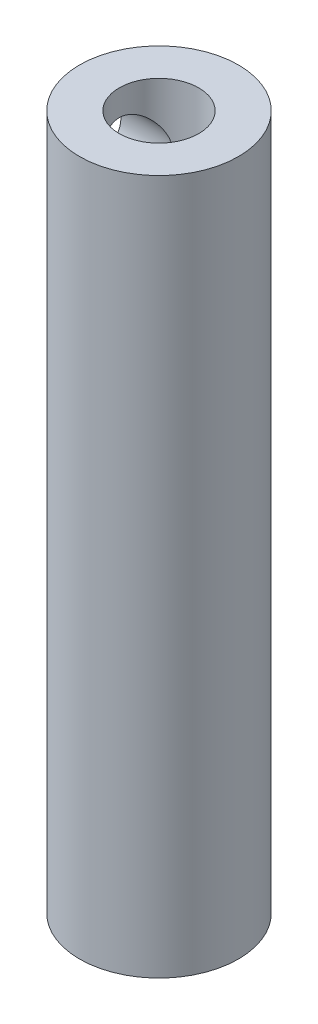
ISO-10303-21;
HEADER;
FILE_DESCRIPTION(('STEP AP214'),'2;1');
FILE_NAME('part.step','',(''),(''),'','','');
FILE_SCHEMA(('AUTOMOTIVE_DESIGN { 1 0 10303 214 1 1 1 1 }'));
ENDSEC;
DATA;
#1=APPLICATION_CONTEXT('core data for automotive mechanical design processes');
#2=APPLICATION_PROTOCOL_DEFINITION('international standard','automotive_design',2000,#1);
#3=PRODUCT_CONTEXT('',#1,'mechanical');
#4=PRODUCT('Part','Part','',(#3));
#5=PRODUCT_RELATED_PRODUCT_CATEGORY('part','',(#4));
#6=PRODUCT_DEFINITION_FORMATION('','',#4);
#7=PRODUCT_DEFINITION_CONTEXT('part definition',#1,'design');
#8=PRODUCT_DEFINITION('design','',#6,#7);
#9=PRODUCT_DEFINITION_SHAPE('','',#8);
#10=(LENGTH_UNIT() NAMED_UNIT(*) SI_UNIT(.MILLI.,.METRE.));
#11=(NAMED_UNIT(*) PLANE_ANGLE_UNIT() SI_UNIT($,.RADIAN.));
#12=(NAMED_UNIT(*) SI_UNIT($,.STERADIAN.) SOLID_ANGLE_UNIT());
#13=UNCERTAINTY_MEASURE_WITH_UNIT(LENGTH_MEASURE(1.E-05),#10,'distance_accuracy_value','');
#14=(GEOMETRIC_REPRESENTATION_CONTEXT(3) GLOBAL_UNCERTAINTY_ASSIGNED_CONTEXT((#13)) GLOBAL_UNIT_ASSIGNED_CONTEXT((#10,
#11,#12)) REPRESENTATION_CONTEXT('',''));
#15=CARTESIAN_POINT('',(0.,0.,0.));
#16=DIRECTION('',(0.,0.,1.));
#17=DIRECTION('',(1.,0.,0.));
#18=AXIS2_PLACEMENT_3D('',#15,#16,#17);
#19=CARTESIAN_POINT('',(0.,35.,0.));
#20=DIRECTION('',(0.,-1.,0.));
#21=DIRECTION('',(0.,0.,-1.));
#22=AXIS2_PLACEMENT_3D('',#19,#20,#21);
#23=CYLINDRICAL_SURFACE('',#22,4.);
#24=CARTESIAN_POINT('',(-3.62077339804634,32.,1.7));
#25=CARTESIAN_POINT('',(-3.62078389776822,31.9095136925962,1.69998931587784));
#26=CARTESIAN_POINT('',(-3.62421505367056,31.818887436566,1.69272971233163));
#27=CARTESIAN_POINT('',(-3.63750095648767,31.6402616540762,1.66397708018132));
#28=CARTESIAN_POINT('',(-3.64737281734679,31.5522697809394,1.64244612797097));
#29=CARTESIAN_POINT('',(-3.67220059629412,31.3818244806839,1.58615188365144));
#30=CARTESIAN_POINT('',(-3.68713519255218,31.2993495351598,1.55144401409242));
#31=CARTESIAN_POINT('',(-3.72037538198184,31.1414157505776,1.46994425999662));
#32=CARTESIAN_POINT('',(-3.73868027222187,31.0659554534262,1.42315489444196));
#33=CARTESIAN_POINT('',(-3.77792419156349,30.919259320318,1.31557971646441));
#34=CARTESIAN_POINT('',(-3.79895480957319,30.8485324995426,1.25413286768261));
#35=CARTESIAN_POINT('',(-3.84052932399883,30.7180095016102,1.12037385385952));
#36=CARTESIAN_POINT('',(-3.86107302551083,30.6582176392885,1.0480574201965));
#37=CARTESIAN_POINT('',(-3.90047994287595,30.5486282225362,0.890578070051302));
#38=CARTESIAN_POINT('',(-3.91922435158922,30.499408386334,0.804980679500432));
#39=CARTESIAN_POINT('',(-3.9517936883622,30.4162886166107,0.625779619556143));
#40=CARTESIAN_POINT('',(-3.96562088331569,30.3823816217372,0.532179664191152));
#41=CARTESIAN_POINT('',(-3.98614740911361,30.332710381214,0.344979513320471));
#42=CARTESIAN_POINT('',(-3.99319065604463,30.3160670178677,0.251651070591721));
#43=CARTESIAN_POINT('',(-4.00060815688424,30.2985497752618,0.0632783663420337));
#44=CARTESIAN_POINT('',(-4.00098523182037,30.2976692254058,-0.0317651523372097));
#45=CARTESIAN_POINT('',(-3.99522684956492,30.3112529689857,-0.214458466615303));
#46=CARTESIAN_POINT('',(-3.98950193441317,30.324749910631,-0.302195592459981));
#47=CARTESIAN_POINT('',(-3.97275194397345,30.3650406061082,-0.474021630551051));
#48=CARTESIAN_POINT('',(-3.96172647725524,30.3918353419478,-0.558110272867535));
#49=CARTESIAN_POINT('',(-3.93522368744884,30.4582722750843,-0.721803742779873));
#50=CARTESIAN_POINT('',(-3.91968084499471,30.4981047279113,-0.801320306141919));
#51=CARTESIAN_POINT('',(-3.88565313854627,30.5892953008207,-0.952749650325255));
#52=CARTESIAN_POINT('',(-3.86716722297728,30.640657543254,-1.02465969795704));
#53=CARTESIAN_POINT('',(-3.82750663559037,30.757800507865,-1.16440871156805));
#54=CARTESIAN_POINT('',(-3.80623419529478,30.8243594975726,-1.23156848333512));
#55=CARTESIAN_POINT('',(-3.76439681745492,30.9678239513226,-1.35407381215316));
#56=CARTESIAN_POINT('',(-3.74383217834637,31.0447337141281,-1.40941443577706));
#57=CARTESIAN_POINT('',(-3.70502399721272,31.2101401688352,-1.50855500222399));
#58=CARTESIAN_POINT('',(-3.68688823684044,31.2989504039897,-1.55187769268165));
#59=CARTESIAN_POINT('',(-3.65628757041348,31.4835805163489,-1.62267252189394));
#60=CARTESIAN_POINT('',(-3.64381842070352,31.5793950854602,-1.6501565261958));
#61=CARTESIAN_POINT('',(-3.62702749350719,31.7684983019597,-1.68672841059021));
#62=CARTESIAN_POINT('',(-3.62221773340993,31.8615291175216,-1.69692109964447));
#63=CARTESIAN_POINT('',(-3.61989322841417,32.0480762325109,-1.70187704278063));
#64=CARTESIAN_POINT('',(-3.62237578496444,32.1415923395692,-1.69664600447243));
#65=CARTESIAN_POINT('',(-3.63385039181918,32.3197683825884,-1.67191223339995));
#66=CARTESIAN_POINT('',(-3.64238974686291,32.4045989220652,-1.65340103574668));
#67=CARTESIAN_POINT('',(-3.66442865789702,32.5698728304785,-1.60396059683754));
#68=CARTESIAN_POINT('',(-3.67792940476492,32.650315140785,-1.57302837401107));
#69=CARTESIAN_POINT('',(-3.7090779402313,32.8084134508917,-1.49814807525468));
#70=CARTESIAN_POINT('',(-3.72687955099295,32.8857993962254,-1.45369590780971));
#71=CARTESIAN_POINT('',(-3.76441339227635,33.0323950596591,-1.35353226876144));
#72=CARTESIAN_POINT('',(-3.78414647967388,33.1016011185229,-1.29781578809865));
#73=CARTESIAN_POINT('',(-3.82535166604392,33.2360237838682,-1.17110429325259));
#74=CARTESIAN_POINT('',(-3.84682843975983,33.3003957330982,-1.09921112338328));
#75=CARTESIAN_POINT('',(-3.88754721100944,33.416324110372,-0.945155108949408));
#76=CARTESIAN_POINT('',(-3.90678900343043,33.4678793626733,-0.862991323245852));
#77=CARTESIAN_POINT('',(-3.94103107719546,33.556733022639,-0.689980032155145));
#78=CARTESIAN_POINT('',(-3.95601331647128,33.5939710147984,-0.599097707378483));
#79=CARTESIAN_POINT('',(-3.97989121280153,33.6523470048471,-0.411555216738269));
#80=CARTESIAN_POINT('',(-3.98879065469919,33.6734950151868,-0.314898684498714));
#81=CARTESIAN_POINT('',(-3.9990489958153,33.6977931006144,-0.126084955840315));
#82=CARTESIAN_POINT('',(-4.00090603247313,33.7021326282122,-0.0341069160918674));
#83=CARTESIAN_POINT('',(-3.99826543244609,33.6959174191764,0.149241085779918));
#84=CARTESIAN_POINT('',(-3.99376899105789,33.6853654841136,0.240611159032687));
#85=CARTESIAN_POINT('',(-3.97919382980664,33.6505207493148,0.416560481880022));
#86=CARTESIAN_POINT('',(-3.96933380737085,33.6267655308726,0.501265842353938));
#87=CARTESIAN_POINT('',(-3.94513266199835,33.5667872702492,0.665447707792311));
#88=CARTESIAN_POINT('',(-3.93079070613533,33.5305619104791,0.744923237514438));
#89=CARTESIAN_POINT('',(-3.8981931765112,33.4448358087029,0.900380438212713));
#90=CARTESIAN_POINT('',(-3.87978917350281,33.3948058369909,0.976038394360143));
#91=CARTESIAN_POINT('',(-3.84122862577445,33.2836481674676,1.118211865535));
#92=CARTESIAN_POINT('',(-3.8210714015288,33.2225161565732,1.18472380967696));
#93=CARTESIAN_POINT('',(-3.77946315895161,33.0857613862788,1.31165271688526));
#94=CARTESIAN_POINT('',(-3.75802228942074,33.0094164933923,1.37129773860273));
#95=CARTESIAN_POINT('',(-3.71772952713886,32.8471570184193,1.47705876845357));
#96=CARTESIAN_POINT('',(-3.69887912452728,32.7612369793602,1.52316700687638));
#97=CARTESIAN_POINT('',(-3.66623132404758,32.582210832153,1.60015623012625));
#98=CARTESIAN_POINT('',(-3.65241922289075,32.4891266098767,1.63108161598059));
#99=CARTESIAN_POINT('',(-3.63183106374555,32.2984664254959,1.67643974797453));
#100=CARTESIAN_POINT('',(-3.62503141264755,32.2009066860975,1.69092781340853));
#101=CARTESIAN_POINT('',(-3.62125776494451,32.0686373471819,1.69896477261701));
#102=CARTESIAN_POINT('',(-3.62076941465609,32.0343287449659,1.70000405334813));
#103=CARTESIAN_POINT('',(-3.62077339804634,32.,1.7));
#104=B_SPLINE_CURVE_WITH_KNOTS('',3,(#24,#25,#26,#27,#28,#29,#30,#31,#32,#33,#34,#35,#36,#37,
#38,#39,#40,#41,#42,#43,#44,#45,#46,#47,#48,#49,#50,#51,#52,#53,#54,#55,#56,#57,#58,#59,#60,#61,
#62,#63,#64,#65,#66,#67,#68,#69,#70,#71,#72,#73,#74,#75,#76,#77,#78,#79,#80,#81,#82,#83,#84,#85,
#86,#87,#88,#89,#90,#91,#92,#93,#94,#95,#96,#97,#98,#99,#100,#101,#102,#103),.UNSPECIFIED.,.T.,
.F.,(4,2,2,2,2,2,2,2,2,2,2,2,2,2,2,2,2,2,2,2,2,2,2,2,2,2,2,2,2,2,2,2,2,2,2,2,2,2,2,4),(0.,
0.271357429217211,0.543438849684194,0.81438834225994,1.08528138763888,1.3720970991645,
1.65902574252361,1.95899463692504,2.25882506229057,2.54250020592688,2.82605529947181,
3.09166970443069,3.35730372725016,3.62700110584538,3.89679506582232,4.18626169238784,
4.47584891000081,4.77567555447247,5.07527729092642,5.35489435511071,5.63440795890816,
5.89497300357031,6.15560063227203,6.42747562422463,6.69947178160411,6.99468311182854,
7.28992151334518,7.58639242540035,7.88267869873597,8.15756828963533,8.4324061717119,
8.69679659632972,8.96123618473687,9.23771295195231,9.51429735959075,9.81058879533077,
10.1070499625391,10.4026389106496,10.6972300845991,10.800177815029),.UNSPECIFIED.);
#105=CARTESIAN_POINT('',(-3.62077339804634,32.,1.7));
#106=VERTEX_POINT('',#105);
#107=EDGE_CURVE('E10',#106,#106,#104,.T.);
#108=ORIENTED_EDGE('',*,*,#107,.T.);
#109=EDGE_LOOP('',(#108));
#110=FACE_BOUND('',#109,.T.);
#111=CARTESIAN_POINT('',(0.,35.,0.));
#112=DIRECTION('',(0.,1.,0.));
#113=DIRECTION('',(0.,0.,1.));
#114=AXIS2_PLACEMENT_3D('',#111,#112,#113);
#115=CIRCLE('',#114,4.);
#116=CARTESIAN_POINT('',(0.,35.,4.));
#117=VERTEX_POINT('',#116);
#118=EDGE_CURVE('E41',#117,#117,#115,.T.);
#119=ORIENTED_EDGE('',*,*,#118,.F.);
#120=EDGE_LOOP('',(#119));
#121=FACE_BOUND('',#120,.T.);
#122=CARTESIAN_POINT('',(0.,0.,0.));
#123=DIRECTION('',(0.,1.,0.));
#124=DIRECTION('',(0.,0.,1.));
#125=AXIS2_PLACEMENT_3D('',#122,#123,#124);
#126=CIRCLE('',#125,4.);
#127=CARTESIAN_POINT('',(0.,0.,4.));
#128=VERTEX_POINT('',#127);
#129=EDGE_CURVE('E45',#128,#128,#126,.T.);
#130=ORIENTED_EDGE('',*,*,#129,.T.);
#131=EDGE_LOOP('',(#130));
#132=FACE_BOUND('',#131,.T.);
#133=ADVANCED_FACE('F31',(#110,#121,#132),#23,.T.);
#134=CARTESIAN_POINT('',(0.,35.,0.));
#135=DIRECTION('',(0.,1.,0.));
#136=DIRECTION('',(0.,0.,1.));
#137=AXIS2_PLACEMENT_3D('',#134,#135,#136);
#138=PLANE('',#137);
#139=CARTESIAN_POINT('',(0.,35.,0.));
#140=DIRECTION('',(0.,1.,0.));
#141=DIRECTION('',(0.,0.,1.));
#142=AXIS2_PLACEMENT_3D('',#139,#140,#141);
#143=CIRCLE('',#142,2.);
#144=CARTESIAN_POINT('',(0.,35.,2.));
#145=VERTEX_POINT('',#144);
#146=EDGE_CURVE('E52',#145,#145,#143,.T.);
#147=ORIENTED_EDGE('',*,*,#146,.F.);
#148=EDGE_LOOP('',(#147));
#149=FACE_BOUND('',#148,.T.);
#150=ORIENTED_EDGE('',*,*,#118,.T.);
#151=EDGE_LOOP('',(#150));
#152=FACE_BOUND('',#151,.T.);
#153=ADVANCED_FACE('F80',(#149,#152),#138,.T.);
#154=CARTESIAN_POINT('',(0.,0.,0.));
#155=DIRECTION('',(0.,1.,0.));
#156=DIRECTION('',(0.,0.,1.));
#157=AXIS2_PLACEMENT_3D('',#154,#155,#156);
#158=PLANE('',#157);
#159=ORIENTED_EDGE('',*,*,#129,.F.);
#160=EDGE_LOOP('',(#159));
#161=FACE_BOUND('',#160,.T.);
#162=ADVANCED_FACE('F77',(#161),#158,.F.);
#163=CARTESIAN_POINT('',(0.,25.,0.));
#164=DIRECTION('',(0.,1.,0.));
#165=DIRECTION('',(0.,0.,1.));
#166=AXIS2_PLACEMENT_3D('',#163,#164,#165);
#167=CYLINDRICAL_SURFACE('',#166,2.);
#168=CARTESIAN_POINT('',(-1.05356537528528,32.,1.7));
#169=CARTESIAN_POINT('',(-1.0535865391497,32.0579969876084,1.69999209353776));
#170=CARTESIAN_POINT('',(-1.05846416247034,32.1160712056181,1.69699341427168));
#171=CARTESIAN_POINT('',(-1.07694415181595,32.2302941941207,1.68531810769261));
#172=CARTESIAN_POINT('',(-1.09057797998307,32.2864352489887,1.67662100293753));
#173=CARTESIAN_POINT('',(-1.13108259855175,32.4180078786746,1.64968082581871));
#174=CARTESIAN_POINT('',(-1.16108669082666,32.4919371171079,1.62898823756465));
#175=CARTESIAN_POINT('',(-1.22787010969714,32.6337248046924,1.57926447079485));
#176=CARTESIAN_POINT('',(-1.26467231483019,32.701561568797,1.55020494374478));
#177=CARTESIAN_POINT('',(-1.33159048933568,32.8152672380987,1.49274984380142));
#178=CARTESIAN_POINT('',(-1.36106425910824,32.8623743748959,1.46602060494138));
#179=CARTESIAN_POINT('',(-1.4206068170519,32.9535810134619,1.40840212528898));
#180=CARTESIAN_POINT('',(-1.4506758793521,32.9976790859571,1.37751092804804));
#181=CARTESIAN_POINT('',(-1.540391428907,33.1253921130372,1.27870069797039));
#182=CARTESIAN_POINT('',(-1.59967379601292,33.204629062381,1.20454185093214));
#183=CARTESIAN_POINT('',(-1.6991559367518,33.3335598904778,1.05779848838552));
#184=CARTESIAN_POINT('',(-1.74068803635965,33.385920768851,0.988441684600398));
#185=CARTESIAN_POINT('',(-1.81701226861221,33.480650604137,0.839882315936324));
#186=CARTESIAN_POINT('',(-1.85181552120821,33.523036071839,0.760696356430929));
#187=CARTESIAN_POINT('',(-1.90658117573437,33.5891273039267,0.608501762552866));
#188=CARTESIAN_POINT('',(-1.92808383853929,33.6148170149589,0.536914240950147));
#189=CARTESIAN_POINT('',(-1.96324342803797,33.6566395251948,0.389137658874133));
#190=CARTESIAN_POINT('',(-1.97690494882648,33.6727779206503,0.312951321808487));
#191=CARTESIAN_POINT('',(-1.99531639754419,33.6944973023532,0.157641560880517));
#192=CARTESIAN_POINT('',(-2.00002539694724,33.7000298022473,0.0785063262071438));
#193=CARTESIAN_POINT('',(-1.99997440786115,33.6999699681093,-0.0797561244111584));
#194=CARTESIAN_POINT('',(-1.99521519509274,33.6943785454486,-0.158883340481886));
#195=CARTESIAN_POINT('',(-1.97736113063873,33.6733154790453,-0.308737410975696));
#196=CARTESIAN_POINT('',(-1.96490923253137,33.6586056552615,-0.379652571436747));
#197=CARTESIAN_POINT('',(-1.93315996846712,33.6208673962779,-0.517596839641206));
#198=CARTESIAN_POINT('',(-1.91386152687525,33.5978376539564,-0.584625334838861));
#199=CARTESIAN_POINT('',(-1.86781902754465,33.5424026866156,-0.718801577563779));
#200=CARTESIAN_POINT('',(-1.84060628121434,33.5093993180463,-0.785538209496984));
#201=CARTESIAN_POINT('',(-1.78109652308424,33.436229850535,-0.912480875898615));
#202=CARTESIAN_POINT('',(-1.74879554087872,33.3960581547916,-0.972681747952854));
#203=CARTESIAN_POINT('',(-1.66367783669771,33.2881848025844,-1.11444505894733));
#204=CARTESIAN_POINT('',(-1.60862821526641,33.2167072637636,-1.19180461135557));
#205=CARTESIAN_POINT('',(-1.49519576454598,33.0622669623057,-1.33134355517151));
#206=CARTESIAN_POINT('',(-1.43680588820473,32.9792793488295,-1.39348927403084));
#207=CARTESIAN_POINT('',(-1.33560565081163,32.8225278157227,-1.48992153907624));
#208=CARTESIAN_POINT('',(-1.29228603965747,32.7509944251612,-1.52732903885879));
#209=CARTESIAN_POINT('',(-1.21115764881017,32.6007563716037,-1.59240971181971));
#210=CARTESIAN_POINT('',(-1.17333262599745,32.5220740117466,-1.62011193334315));
#211=CARTESIAN_POINT('',(-1.12174912939406,32.3880115626178,-1.65598220392296));
#212=CARTESIAN_POINT('',(-1.10429085307099,32.335007261131,-1.66757817522879));
#213=CARTESIAN_POINT('',(-1.07634688979503,32.2264025966488,-1.68575136889507));
#214=CARTESIAN_POINT('',(-1.06584358593808,32.170809177588,-1.69234127787066));
#215=CARTESIAN_POINT('',(-1.05364022423823,32.0576891921143,-1.69997188075843));
#216=CARTESIAN_POINT('',(-1.05202380560274,32.0001493702366,-1.70095985458385));
#217=CARTESIAN_POINT('',(-1.05819368520095,31.8857546666464,-1.69712521354873));
#218=CARTESIAN_POINT('',(-1.06598990302157,31.8289005714107,-1.69229646870194));
#219=CARTESIAN_POINT('',(-1.09174803921428,31.7063831938381,-1.67581445898948));
#220=CARTESIAN_POINT('',(-1.11144700712543,31.6412637551221,-1.66297849578291));
#221=CARTESIAN_POINT('',(-1.15819537133674,31.5153639909899,-1.63076153967505));
#222=CARTESIAN_POINT('',(-1.18527033957442,31.4545997078671,-1.61135771876846));
#223=CARTESIAN_POINT('',(-1.23839222376261,31.3478086163342,-1.57076420948407));
#224=CARTESIAN_POINT('',(-1.26376891139426,31.3010801036612,-1.55050252767248));
#225=CARTESIAN_POINT('',(-1.31613618649843,31.2103264983711,-1.50630785201208));
#226=CARTESIAN_POINT('',(-1.34312773977883,31.166303056138,-1.48237264746023));
#227=CARTESIAN_POINT('',(-1.42515792176047,31.0379984781566,-1.40518374468282));
#228=CARTESIAN_POINT('',(-1.48122788454067,30.9575276545874,-1.34656406295446));
#229=CARTESIAN_POINT('',(-1.59308814278739,30.8038523323277,-1.21245869465718));
#230=CARTESIAN_POINT('',(-1.64876806742133,30.7310941751382,-1.13636871801782));
#231=CARTESIAN_POINT('',(-1.75240887594904,30.5990734955405,-0.968861849498815));
#232=CARTESIAN_POINT('',(-1.80039286591852,30.5397703450762,-0.877492585814875));
#233=CARTESIAN_POINT('',(-1.8705603997189,30.4542373032738,-0.711602749491723));
#234=CARTESIAN_POINT('',(-1.89611023700009,30.4234733378396,-0.64083760329226));
#235=CARTESIAN_POINT('',(-1.93962462353878,30.3713961005599,-0.493683487802223));
#236=CARTESIAN_POINT('',(-1.9575948217246,30.350075789982,-0.417298756698768));
#237=CARTESIAN_POINT('',(-1.98460480421611,30.3181172086044,-0.260242591839756));
#238=CARTESIAN_POINT('',(-1.99358857090647,30.3075459361047,-0.179547531981826));
#239=CARTESIAN_POINT('',(-2.00158035195772,30.2981390046393,-0.0169856320256852));
#240=CARTESIAN_POINT('',(-2.00059177312242,30.2992993378625,0.0648807983594134));
#241=CARTESIAN_POINT('',(-1.98932419140323,30.3125699293231,0.21907037132619));
#242=CARTESIAN_POINT('',(-1.97994433068417,30.3236204805623,0.29155638997955));
#243=CARTESIAN_POINT('',(-1.95384288748472,30.3545303540401,0.433231940291043));
#244=CARTESIAN_POINT('',(-1.93711972391115,30.3743915733211,0.50242075846762));
#245=CARTESIAN_POINT('',(-1.89653927098457,30.422962384739,0.639099574523981));
#246=CARTESIAN_POINT('',(-1.87239791787222,30.4520260370968,0.706377365385048));
#247=CARTESIAN_POINT('',(-1.81872179526714,30.5174022780211,0.834932229603046));
#248=CARTESIAN_POINT('',(-1.78918566938265,30.5537166898389,0.896207787870503));
#249=CARTESIAN_POINT('',(-1.71091060380423,30.6515005503062,1.0403705430262));
#250=CARTESIAN_POINT('',(-1.65977349850707,30.7166626502332,1.11945639862046));
#251=CARTESIAN_POINT('',(-1.55283945613768,30.8582842851909,1.26363362707695));
#252=CARTESIAN_POINT('',(-1.49702395653074,30.934789848882,1.32866519761275));
#253=CARTESIAN_POINT('',(-1.41297411987472,31.057979028225,1.41604686738013));
#254=CARTESIAN_POINT('',(-1.38462093167345,31.1009153762359,1.44370098494875));
#255=CARTESIAN_POINT('',(-1.32876164714129,31.1895686034912,1.49527077077826));
#256=CARTESIAN_POINT('',(-1.30125604387866,31.2352870568377,1.51918429479166));
#257=CARTESIAN_POINT('',(-1.24826463387982,31.3294235289084,1.56301367792193));
#258=CARTESIAN_POINT('',(-1.22277046023881,31.3778287629546,1.58294669002176));
#259=CARTESIAN_POINT('',(-1.17511740131887,31.4776773758036,1.61863632739282));
#260=CARTESIAN_POINT('',(-1.15295358494648,31.529116102618,1.63439915410738));
#261=CARTESIAN_POINT('',(-1.1139561494244,31.6348935805192,1.66122222386113));
#262=CARTESIAN_POINT('',(-1.09709510990122,31.6892156564824,1.67230676348317));
#263=CARTESIAN_POINT('',(-1.07097877600694,31.8003484786753,1.689159508811));
#264=CARTESIAN_POINT('',(-1.06169078613592,31.8571473992388,1.69495058152883));
#265=CARTESIAN_POINT('',(-1.05472385187238,31.9428584986647,1.69928151774383));
#266=CARTESIAN_POINT('',(-1.05355494602029,31.9714198720766,1.70000389619722));
#267=CARTESIAN_POINT('',(-1.05356537528528,32.,1.7));
#268=B_SPLINE_CURVE_WITH_KNOTS('',3,(#168,#169,#170,#171,#172,#173,#174,#175,#176,#177,#178,
#179,#180,#181,#182,#183,#184,#185,#186,#187,#188,#189,#190,#191,#192,#193,#194,#195,#196,#197,
#198,#199,#200,#201,#202,#203,#204,#205,#206,#207,#208,#209,#210,#211,#212,#213,#214,#215,#216,
#217,#218,#219,#220,#221,#222,#223,#224,#225,#226,#227,#228,#229,#230,#231,#232,#233,#234,#235,
#236,#237,#238,#239,#240,#241,#242,#243,#244,#245,#246,#247,#248,#249,#250,#251,#252,#253,#254,
#255,#256,#257,#258,#259,#260,#261,#262,#263,#264,#265,#266,#267),.UNSPECIFIED.,.T.,.F.,(4,2,2,
2,2,2,2,2,2,2,2,2,2,2,2,2,2,2,2,2,2,2,2,2,2,2,2,2,2,2,2,2,2,2,2,2,2,2,2,2,2,2,2,2,2,2,2,2,2,4),
(0.,0.173879418884634,0.34838713050625,0.594273916217876,0.841003812098058,1.02576540468018,
1.2106141547992,1.57953716462817,1.86747817174354,2.15493918820206,2.39107901360164,
2.6270803439883,2.86415803868535,3.1012163106546,3.32073083217672,3.54027985609209,
3.77721956251101,4.0143450798563,4.36900968073956,4.72445229908044,4.99861224866161,
5.27194447018501,5.44239988394004,5.61242186648947,5.78404131184428,5.95584177779075,
6.16238745176459,6.36965851995739,6.54014677695168,6.71073803794905,7.05207950002438,
7.40773795752544,7.76230775425531,8.00521725422385,8.24794539815097,8.49217735008232,
8.73632586906829,8.95708375667679,9.1778891991903,9.40850919092569,9.63918724678179,
9.98094346037337,10.3241264325837,10.499217898416,10.6744093682521,10.8488287825195,
11.0229873424942,11.1962299392967,11.3687205667594,11.4544059831902),.UNSPECIFIED.);
#269=CARTESIAN_POINT('',(-1.05356537528528,32.,1.7));
#270=VERTEX_POINT('',#269);
#271=EDGE_CURVE('E55',#270,#270,#268,.T.);
#272=ORIENTED_EDGE('',*,*,#271,.T.);
#273=EDGE_LOOP('',(#272));
#274=FACE_BOUND('',#273,.T.);
#275=CARTESIAN_POINT('',(0.,25.,0.));
#276=DIRECTION('',(0.,1.,0.));
#277=DIRECTION('',(0.,0.,1.));
#278=AXIS2_PLACEMENT_3D('',#275,#276,#277);
#279=CIRCLE('',#278,2.);
#280=CARTESIAN_POINT('',(0.,25.,2.));
#281=VERTEX_POINT('',#280);
#282=EDGE_CURVE('E50',#281,#281,#279,.T.);
#283=ORIENTED_EDGE('',*,*,#282,.F.);
#284=EDGE_LOOP('',(#283));
#285=FACE_BOUND('',#284,.T.);
#286=ORIENTED_EDGE('',*,*,#146,.T.);
#287=EDGE_LOOP('',(#286));
#288=FACE_BOUND('',#287,.T.);
#289=ADVANCED_FACE('F62',(#274,#285,#288),#167,.F.);
#290=CARTESIAN_POINT('',(0.,25.,0.));
#291=DIRECTION('',(0.,1.,0.));
#292=DIRECTION('',(0.,0.,1.));
#293=AXIS2_PLACEMENT_3D('',#290,#291,#292);
#294=PLANE('',#293);
#295=ORIENTED_EDGE('',*,*,#282,.T.);
#296=EDGE_LOOP('',(#295));
#297=FACE_BOUND('',#296,.T.);
#298=ADVANCED_FACE('F69',(#297),#294,.T.);
#299=CARTESIAN_POINT('',(-4.,32.,0.));
#300=DIRECTION('',(-1.,0.,0.));
#301=DIRECTION('',(0.,0.,1.));
#302=AXIS2_PLACEMENT_3D('',#299,#300,#301);
#303=CYLINDRICAL_SURFACE('',#302,1.7);
#304=ORIENTED_EDGE('',*,*,#107,.F.);
#305=EDGE_LOOP('',(#304));
#306=FACE_BOUND('',#305,.T.);
#307=ORIENTED_EDGE('',*,*,#271,.F.);
#308=EDGE_LOOP('',(#307));
#309=FACE_BOUND('',#308,.T.);
#310=ADVANCED_FACE('F66',(#306,#309),#303,.F.);
#311=CLOSED_SHELL('',(#133,#153,#162,#289,#298,#310));
#312=MANIFOLD_SOLID_BREP('B2',#311);
#313=ADVANCED_BREP_SHAPE_REPRESENTATION('',(#18,#312),#14);
#314=SHAPE_DEFINITION_REPRESENTATION(#9,#313);
ENDSEC;
END-ISO-10303-21;
